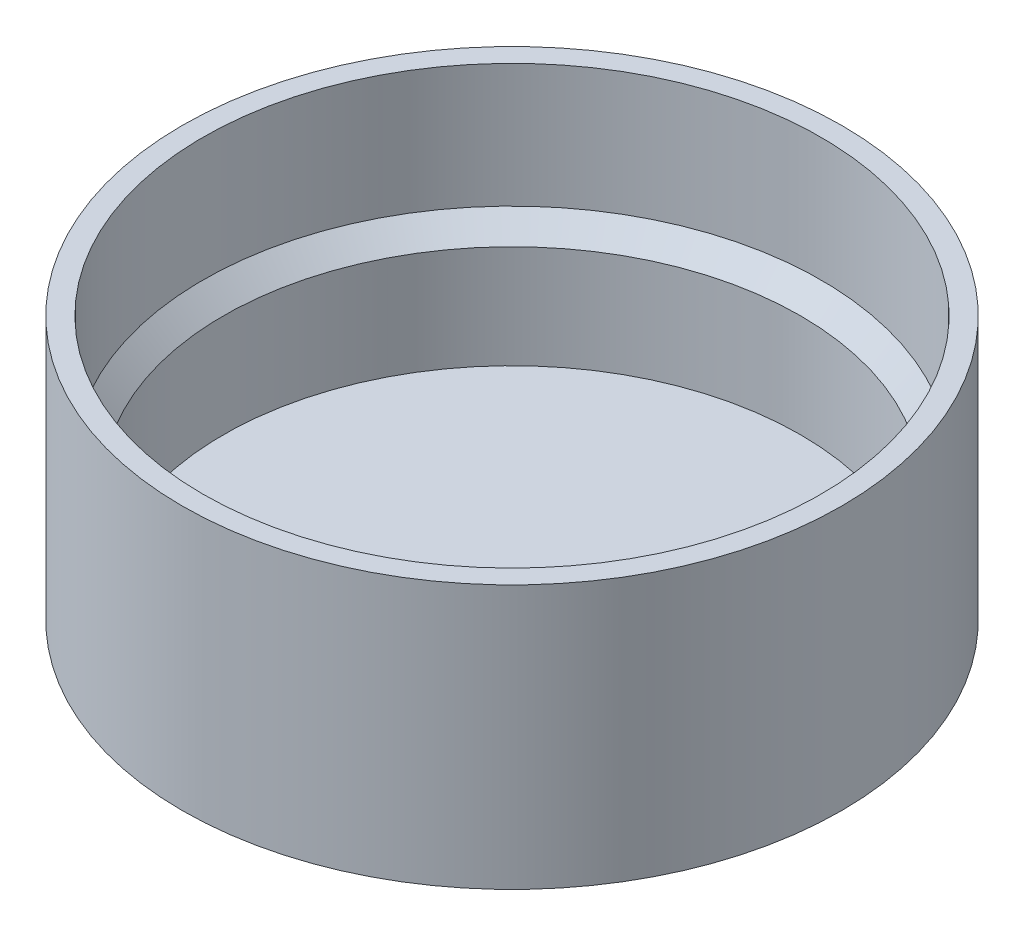
ISO-10303-21;
HEADER;
FILE_DESCRIPTION(('STEP AP214'),'2;1');
FILE_NAME('part.step','',(''),(''),'','','');
FILE_SCHEMA(('AUTOMOTIVE_DESIGN { 1 0 10303 214 1 1 1 1 }'));
ENDSEC;
DATA;
#1=APPLICATION_CONTEXT('core data for automotive mechanical design processes');
#2=APPLICATION_PROTOCOL_DEFINITION('international standard','automotive_design',2000,#1);
#3=PRODUCT_CONTEXT('',#1,'mechanical');
#4=PRODUCT('Part','Part','',(#3));
#5=PRODUCT_RELATED_PRODUCT_CATEGORY('part','',(#4));
#6=PRODUCT_DEFINITION_FORMATION('','',#4);
#7=PRODUCT_DEFINITION_CONTEXT('part definition',#1,'design');
#8=PRODUCT_DEFINITION('design','',#6,#7);
#9=PRODUCT_DEFINITION_SHAPE('','',#8);
#10=(LENGTH_UNIT() NAMED_UNIT(*) SI_UNIT(.MILLI.,.METRE.));
#11=(NAMED_UNIT(*) PLANE_ANGLE_UNIT() SI_UNIT($,.RADIAN.));
#12=(NAMED_UNIT(*) SI_UNIT($,.STERADIAN.) SOLID_ANGLE_UNIT());
#13=UNCERTAINTY_MEASURE_WITH_UNIT(LENGTH_MEASURE(1.E-05),#10,'distance_accuracy_value','');
#14=(GEOMETRIC_REPRESENTATION_CONTEXT(3) GLOBAL_UNCERTAINTY_ASSIGNED_CONTEXT((#13)) GLOBAL_UNIT_ASSIGNED_CONTEXT((#10,
#11,#12)) REPRESENTATION_CONTEXT('',''));
#15=CARTESIAN_POINT('',(0.,0.,0.));
#16=DIRECTION('',(0.,0.,1.));
#17=DIRECTION('',(1.,0.,0.));
#18=AXIS2_PLACEMENT_3D('',#15,#16,#17);
#19=CARTESIAN_POINT('',(0.,2.,0.));
#20=DIRECTION('',(0.,-1.,0.));
#21=DIRECTION('',(0.,0.,-1.));
#22=AXIS2_PLACEMENT_3D('',#19,#20,#21);
#23=CYLINDRICAL_SURFACE('',#22,40.);
#24=CARTESIAN_POINT('',(0.,0.,0.));
#25=DIRECTION('',(0.,1.,0.));
#26=DIRECTION('',(0.,0.,1.));
#27=AXIS2_PLACEMENT_3D('',#24,#25,#26);
#28=CIRCLE('',#27,40.);
#29=CARTESIAN_POINT('',(0.,0.,40.));
#30=VERTEX_POINT('',#29);
#31=EDGE_CURVE('E58',#30,#30,#28,.T.);
#32=ORIENTED_EDGE('',*,*,#31,.T.);
#33=EDGE_LOOP('',(#32));
#34=FACE_BOUND('',#33,.T.);
#35=CARTESIAN_POINT('',(0.,32.,0.));
#36=DIRECTION('',(0.,1.,0.));
#37=DIRECTION('',(0.,0.,1.));
#38=AXIS2_PLACEMENT_3D('',#35,#36,#37);
#39=CIRCLE('',#38,40.);
#40=CARTESIAN_POINT('',(0.,32.,40.));
#41=VERTEX_POINT('',#40);
#42=EDGE_CURVE('E62',#41,#41,#39,.T.);
#43=ORIENTED_EDGE('',*,*,#42,.F.);
#44=EDGE_LOOP('',(#43));
#45=FACE_BOUND('',#44,.T.);
#46=ADVANCED_FACE('F46',(#34,#45),#23,.T.);
#47=CARTESIAN_POINT('',(0.,0.,0.));
#48=DIRECTION('',(0.,1.,0.));
#49=DIRECTION('',(0.,0.,1.));
#50=AXIS2_PLACEMENT_3D('',#47,#48,#49);
#51=PLANE('',#50);
#52=ORIENTED_EDGE('',*,*,#31,.F.);
#53=EDGE_LOOP('',(#52));
#54=FACE_BOUND('',#53,.T.);
#55=ADVANCED_FACE('F86',(#54),#51,.F.);
#56=CARTESIAN_POINT('',(0.,32.,0.));
#57=DIRECTION('',(0.,1.,0.));
#58=DIRECTION('',(0.,0.,1.));
#59=AXIS2_PLACEMENT_3D('',#56,#57,#58);
#60=PLANE('',#59);
#61=CARTESIAN_POINT('',(0.,32.,0.));
#62=DIRECTION('',(0.,1.,0.));
#63=DIRECTION('',(0.,0.,1.));
#64=AXIS2_PLACEMENT_3D('',#61,#62,#63);
#65=CIRCLE('',#64,37.5);
#66=CARTESIAN_POINT('',(0.,32.,37.5));
#67=VERTEX_POINT('',#66);
#68=EDGE_CURVE('E68',#67,#67,#65,.T.);
#69=ORIENTED_EDGE('',*,*,#68,.F.);
#70=EDGE_LOOP('',(#69));
#71=FACE_BOUND('',#70,.T.);
#72=ORIENTED_EDGE('',*,*,#42,.T.);
#73=EDGE_LOOP('',(#72));
#74=FACE_BOUND('',#73,.T.);
#75=ADVANCED_FACE('F80',(#71,#74),#60,.T.);
#76=CARTESIAN_POINT('',(0.,17.,0.));
#77=DIRECTION('',(0.,1.,0.));
#78=DIRECTION('',(0.,0.,1.));
#79=AXIS2_PLACEMENT_3D('',#76,#77,#78);
#80=CYLINDRICAL_SURFACE('',#79,37.5);
#81=CARTESIAN_POINT('',(0.,17.,0.));
#82=DIRECTION('',(0.,1.,0.));
#83=DIRECTION('',(0.,0.,1.));
#84=AXIS2_PLACEMENT_3D('',#81,#82,#83);
#85=CIRCLE('',#84,37.5);
#86=CARTESIAN_POINT('',(0.,17.,37.5));
#87=VERTEX_POINT('',#86);
#88=EDGE_CURVE('E67',#87,#87,#85,.T.);
#89=ORIENTED_EDGE('',*,*,#88,.F.);
#90=EDGE_LOOP('',(#89));
#91=FACE_BOUND('',#90,.T.);
#92=ORIENTED_EDGE('',*,*,#68,.T.);
#93=EDGE_LOOP('',(#92));
#94=FACE_BOUND('',#93,.T.);
#95=ADVANCED_FACE('F76',(#91,#94),#80,.F.);
#96=CARTESIAN_POINT('',(0.,2.,0.));
#97=DIRECTION('',(0.,1.,0.));
#98=DIRECTION('',(0.,0.,1.));
#99=AXIS2_PLACEMENT_3D('',#96,#97,#98);
#100=PLANE('',#99);
#101=CARTESIAN_POINT('',(0.,2.,0.));
#102=DIRECTION('',(0.,1.,0.));
#103=DIRECTION('',(0.,0.,1.));
#104=AXIS2_PLACEMENT_3D('',#101,#102,#103);
#105=CIRCLE('',#104,35.);
#106=CARTESIAN_POINT('',(0.,2.,35.));
#107=VERTEX_POINT('',#106);
#108=EDGE_CURVE('E54',#107,#107,#105,.F.);
#109=ORIENTED_EDGE('',*,*,#108,.F.);
#110=EDGE_LOOP('',(#109));
#111=FACE_BOUND('',#110,.T.);
#112=ADVANCED_FACE('F79',(#111),#100,.T.);
#113=CARTESIAN_POINT('',(0.,32.,0.));
#114=DIRECTION('',(0.,-1.,0.));
#115=DIRECTION('',(0.,0.,-1.));
#116=AXIS2_PLACEMENT_3D('',#113,#114,#115);
#117=CYLINDRICAL_SURFACE('',#116,35.);
#118=CARTESIAN_POINT('',(0.,14.5,0.));
#119=DIRECTION('',(0.,1.,0.));
#120=DIRECTION('',(0.,0.,1.));
#121=AXIS2_PLACEMENT_3D('',#118,#119,#120);
#122=CIRCLE('',#121,35.);
#123=CARTESIAN_POINT('',(0.,14.5,35.));
#124=VERTEX_POINT('',#123);
#125=EDGE_CURVE('E11',#124,#124,#122,.T.);
#126=ORIENTED_EDGE('',*,*,#125,.T.);
#127=EDGE_LOOP('',(#126));
#128=FACE_BOUND('',#127,.T.);
#129=ORIENTED_EDGE('',*,*,#108,.T.);
#130=EDGE_LOOP('',(#129));
#131=FACE_BOUND('',#130,.T.);
#132=ADVANCED_FACE('F100',(#128,#131),#117,.F.);
#133=CARTESIAN_POINT('',(0.,14.5,0.));
#134=DIRECTION('',(0.,1.,0.));
#135=DIRECTION('',(0.,0.,1.));
#136=AXIS2_PLACEMENT_3D('',#133,#134,#135);
#137=CONICAL_SURFACE('',#136,35.,0.78539816339745);
#138=ORIENTED_EDGE('',*,*,#88,.T.);
#139=EDGE_LOOP('',(#138));
#140=FACE_BOUND('',#139,.T.);
#141=ORIENTED_EDGE('',*,*,#125,.F.);
#142=EDGE_LOOP('',(#141));
#143=FACE_BOUND('',#142,.T.);
#144=ADVANCED_FACE('F49',(#140,#143),#137,.F.);
#145=CLOSED_SHELL('',(#46,#55,#75,#95,#112,#132,#144));
#146=MANIFOLD_SOLID_BREP('B2',#145);
#147=ADVANCED_BREP_SHAPE_REPRESENTATION('',(#18,#146),#14);
#148=SHAPE_DEFINITION_REPRESENTATION(#9,#147);
ENDSEC;
END-ISO-10303-21;
